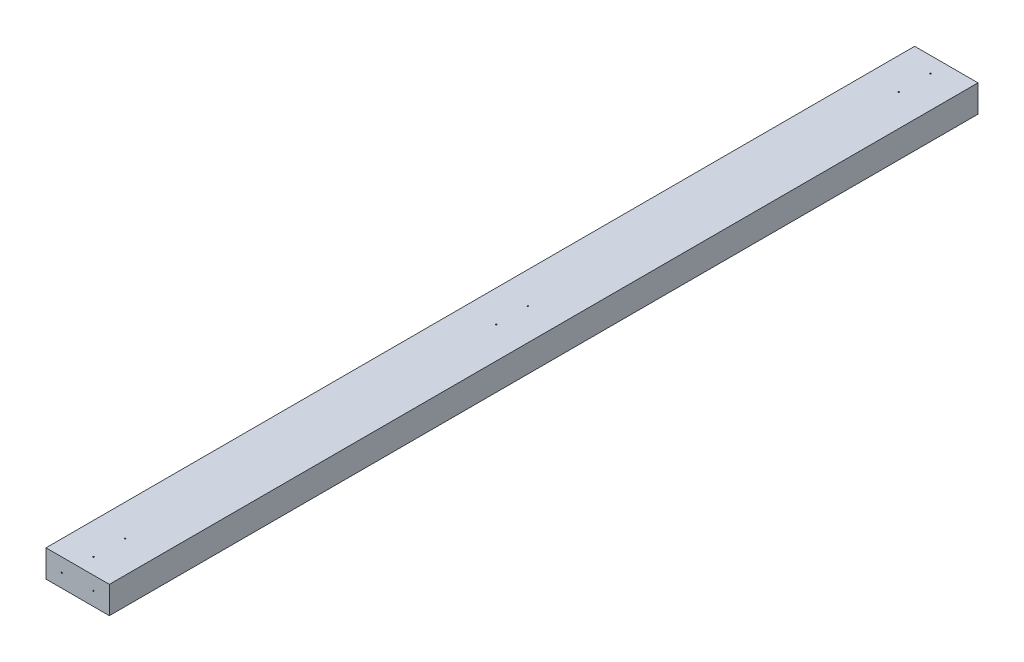
ISO-10303-21;
HEADER;
FILE_DESCRIPTION(('STEP AP214'),'2;1');
FILE_NAME('part.step','',(''),(''),'','','');
FILE_SCHEMA(('AUTOMOTIVE_DESIGN { 1 0 10303 214 1 1 1 1 }'));
ENDSEC;
DATA;
#1=APPLICATION_CONTEXT('core data for automotive mechanical design processes');
#2=APPLICATION_PROTOCOL_DEFINITION('international standard','automotive_design',2000,#1);
#3=PRODUCT_CONTEXT('',#1,'mechanical');
#4=PRODUCT('Part','Part','',(#3));
#5=PRODUCT_RELATED_PRODUCT_CATEGORY('part','',(#4));
#6=PRODUCT_DEFINITION_FORMATION('','',#4);
#7=PRODUCT_DEFINITION_CONTEXT('part definition',#1,'design');
#8=PRODUCT_DEFINITION('design','',#6,#7);
#9=PRODUCT_DEFINITION_SHAPE('','',#8);
#10=(LENGTH_UNIT() NAMED_UNIT(*) SI_UNIT(.MILLI.,.METRE.));
#11=(NAMED_UNIT(*) PLANE_ANGLE_UNIT() SI_UNIT($,.RADIAN.));
#12=(NAMED_UNIT(*) SI_UNIT($,.STERADIAN.) SOLID_ANGLE_UNIT());
#13=UNCERTAINTY_MEASURE_WITH_UNIT(LENGTH_MEASURE(1.E-05),#10,'distance_accuracy_value','');
#14=(GEOMETRIC_REPRESENTATION_CONTEXT(3) GLOBAL_UNCERTAINTY_ASSIGNED_CONTEXT((#13)) GLOBAL_UNIT_ASSIGNED_CONTEXT((#10,
#11,#12)) REPRESENTATION_CONTEXT('',''));
#15=CARTESIAN_POINT('',(0.,0.,0.));
#16=DIRECTION('',(0.,0.,1.));
#17=DIRECTION('',(1.,0.,0.));
#18=AXIS2_PLACEMENT_3D('',#15,#16,#17);
#19=CARTESIAN_POINT('',(0.,0.,1219.2));
#20=DIRECTION('',(1.,0.,0.));
#21=DIRECTION('',(0.,0.,-1.));
#22=AXIS2_PLACEMENT_3D('',#19,#20,#21);
#23=PLANE('',#22);
#24=DIRECTION('',(0.,-1.,0.));
#25=VECTOR('',#24,1.);
#26=CARTESIAN_POINT('',(0.,0.,0.));
#27=LINE('',#26,#25);
#28=CARTESIAN_POINT('',(0.,38.1,0.));
#29=VERTEX_POINT('',#28);
#30=CARTESIAN_POINT('',(0.,0.,0.));
#31=VERTEX_POINT('',#30);
#32=EDGE_CURVE('E95',#29,#31,#27,.T.);
#33=ORIENTED_EDGE('',*,*,#32,.T.);
#34=DIRECTION('',(0.,0.,-1.));
#35=VECTOR('',#34,1.);
#36=CARTESIAN_POINT('',(0.,0.,1219.2));
#37=LINE('',#36,#35);
#38=CARTESIAN_POINT('',(0.,0.,1219.2));
#39=VERTEX_POINT('',#38);
#40=EDGE_CURVE('E11',#39,#31,#37,.T.);
#41=ORIENTED_EDGE('',*,*,#40,.F.);
#42=DIRECTION('',(0.,-1.,0.));
#43=VECTOR('',#42,1.);
#44=CARTESIAN_POINT('',(0.,0.,1219.2));
#45=LINE('',#44,#43);
#46=CARTESIAN_POINT('',(0.,38.1,1219.2));
#47=VERTEX_POINT('',#46);
#48=EDGE_CURVE('E83',#47,#39,#45,.T.);
#49=ORIENTED_EDGE('',*,*,#48,.F.);
#50=DIRECTION('',(0.,0.,-1.));
#51=VECTOR('',#50,1.);
#52=CARTESIAN_POINT('',(0.,38.1,1219.2));
#53=LINE('',#52,#51);
#54=EDGE_CURVE('E91',#47,#29,#53,.T.);
#55=ORIENTED_EDGE('',*,*,#54,.T.);
#56=EDGE_LOOP('',(#33,#41,#49,#55));
#57=FACE_BOUND('',#56,.T.);
#58=ADVANCED_FACE('F32',(#57),#23,.F.);
#59=CARTESIAN_POINT('',(0.,0.,1219.2));
#60=DIRECTION('',(0.,1.,0.));
#61=DIRECTION('',(0.,0.,1.));
#62=AXIS2_PLACEMENT_3D('',#59,#60,#61);
#63=PLANE('',#62);
#64=CARTESIAN_POINT('',(44.45,0.,631.825));
#65=DIRECTION('',(0.,-1.,0.));
#66=DIRECTION('',(0.,0.,-1.));
#67=AXIS2_PLACEMENT_3D('',#64,#65,#66);
#68=CIRCLE('',#67,0.876299999999982);
#69=CARTESIAN_POINT('',(44.45,0.,630.9487));
#70=VERTEX_POINT('',#69);
#71=EDGE_CURVE('E153',#70,#70,#68,.T.);
#72=ORIENTED_EDGE('',*,*,#71,.F.);
#73=EDGE_LOOP('',(#72));
#74=FACE_BOUND('',#73,.T.);
#75=CARTESIAN_POINT('',(44.45,0.,587.375));
#76=DIRECTION('',(0.,-1.,0.));
#77=DIRECTION('',(0.,0.,-1.));
#78=AXIS2_PLACEMENT_3D('',#75,#76,#77);
#79=CIRCLE('',#78,0.876299999999989);
#80=CARTESIAN_POINT('',(44.45,0.,586.4987));
#81=VERTEX_POINT('',#80);
#82=EDGE_CURVE('E147',#81,#81,#79,.T.);
#83=ORIENTED_EDGE('',*,*,#82,.F.);
#84=EDGE_LOOP('',(#83));
#85=FACE_BOUND('',#84,.T.);
#86=CARTESIAN_POINT('',(44.45,0.,66.6750000000005));
#87=DIRECTION('',(0.,-1.,0.));
#88=DIRECTION('',(0.,0.,1.));
#89=AXIS2_PLACEMENT_3D('',#86,#87,#88);
#90=CIRCLE('',#89,0.876299999999982);
#91=CARTESIAN_POINT('',(44.45,0.,67.5513000000005));
#92=VERTEX_POINT('',#91);
#93=EDGE_CURVE('E141',#92,#92,#90,.T.);
#94=ORIENTED_EDGE('',*,*,#93,.F.);
#95=EDGE_LOOP('',(#94));
#96=FACE_BOUND('',#95,.T.);
#97=CARTESIAN_POINT('',(44.45,0.,22.2250000000004));
#98=DIRECTION('',(0.,-1.,0.));
#99=DIRECTION('',(0.,0.,1.));
#100=AXIS2_PLACEMENT_3D('',#97,#98,#99);
#101=CIRCLE('',#100,0.876299999999989);
#102=CARTESIAN_POINT('',(44.45,0.,23.1013000000004));
#103=VERTEX_POINT('',#102);
#104=EDGE_CURVE('E135',#103,#103,#101,.T.);
#105=ORIENTED_EDGE('',*,*,#104,.F.);
#106=EDGE_LOOP('',(#105));
#107=FACE_BOUND('',#106,.T.);
#108=CARTESIAN_POINT('',(44.45,0.,1152.525));
#109=DIRECTION('',(0.,-1.,0.));
#110=DIRECTION('',(0.,0.,-1.));
#111=AXIS2_PLACEMENT_3D('',#108,#109,#110);
#112=CIRCLE('',#111,0.876299999999982);
#113=CARTESIAN_POINT('',(44.45,0.,1151.6487));
#114=VERTEX_POINT('',#113);
#115=EDGE_CURVE('E129',#114,#114,#112,.T.);
#116=ORIENTED_EDGE('',*,*,#115,.F.);
#117=EDGE_LOOP('',(#116));
#118=FACE_BOUND('',#117,.T.);
#119=CARTESIAN_POINT('',(44.45,0.,1196.975));
#120=DIRECTION('',(0.,-1.,0.));
#121=DIRECTION('',(0.,0.,-1.));
#122=AXIS2_PLACEMENT_3D('',#119,#120,#121);
#123=CIRCLE('',#122,0.876299999999989);
#124=CARTESIAN_POINT('',(44.45,0.,1196.0987));
#125=VERTEX_POINT('',#124);
#126=EDGE_CURVE('E123',#125,#125,#123,.T.);
#127=ORIENTED_EDGE('',*,*,#126,.F.);
#128=EDGE_LOOP('',(#127));
#129=FACE_BOUND('',#128,.T.);
#130=DIRECTION('',(1.,0.,0.));
#131=VECTOR('',#130,1.);
#132=CARTESIAN_POINT('',(0.,0.,0.));
#133=LINE('',#132,#131);
#134=CARTESIAN_POINT('',(88.9,0.,0.));
#135=VERTEX_POINT('',#134);
#136=EDGE_CURVE('E87',#31,#135,#133,.T.);
#137=ORIENTED_EDGE('',*,*,#136,.T.);
#138=DIRECTION('',(0.,0.,-1.));
#139=VECTOR('',#138,1.);
#140=CARTESIAN_POINT('',(88.9,0.,1219.2));
#141=LINE('',#140,#139);
#142=CARTESIAN_POINT('',(88.9,0.,1219.2));
#143=VERTEX_POINT('',#142);
#144=EDGE_CURVE('E40',#143,#135,#141,.T.);
#145=ORIENTED_EDGE('',*,*,#144,.F.);
#146=DIRECTION('',(1.,0.,0.));
#147=VECTOR('',#146,1.);
#148=CARTESIAN_POINT('',(0.,0.,1219.2));
#149=LINE('',#148,#147);
#150=EDGE_CURVE('E78',#39,#143,#149,.T.);
#151=ORIENTED_EDGE('',*,*,#150,.F.);
#152=ORIENTED_EDGE('',*,*,#40,.T.);
#153=EDGE_LOOP('',(#137,#145,#151,#152));
#154=FACE_BOUND('',#153,.T.);
#155=ADVANCED_FACE('F86',(#74,#85,#96,#107,#118,#129,#154),#63,.F.);
#156=CARTESIAN_POINT('',(88.9,0.,1219.2));
#157=DIRECTION('',(-1.,0.,0.));
#158=DIRECTION('',(0.,0.,1.));
#159=AXIS2_PLACEMENT_3D('',#156,#157,#158);
#160=PLANE('',#159);
#161=DIRECTION('',(0.,1.,0.));
#162=VECTOR('',#161,1.);
#163=CARTESIAN_POINT('',(88.9,0.,0.));
#164=LINE('',#163,#162);
#165=CARTESIAN_POINT('',(88.9,38.1,0.));
#166=VERTEX_POINT('',#165);
#167=EDGE_CURVE('E65',#135,#166,#164,.T.);
#168=ORIENTED_EDGE('',*,*,#167,.T.);
#169=DIRECTION('',(0.,0.,-1.));
#170=VECTOR('',#169,1.);
#171=CARTESIAN_POINT('',(88.9,38.1,1219.2));
#172=LINE('',#171,#170);
#173=CARTESIAN_POINT('',(88.9,38.1,1219.2));
#174=VERTEX_POINT('',#173);
#175=EDGE_CURVE('E88',#174,#166,#172,.T.);
#176=ORIENTED_EDGE('',*,*,#175,.F.);
#177=DIRECTION('',(0.,1.,0.));
#178=VECTOR('',#177,1.);
#179=CARTESIAN_POINT('',(88.9,0.,1219.2));
#180=LINE('',#179,#178);
#181=EDGE_CURVE('E81',#143,#174,#180,.T.);
#182=ORIENTED_EDGE('',*,*,#181,.F.);
#183=ORIENTED_EDGE('',*,*,#144,.T.);
#184=EDGE_LOOP('',(#168,#176,#182,#183));
#185=FACE_BOUND('',#184,.T.);
#186=ADVANCED_FACE('F89',(#185),#160,.F.);
#187=CARTESIAN_POINT('',(0.,38.1,1219.2));
#188=DIRECTION('',(0.,-1.,0.));
#189=DIRECTION('',(0.,0.,-1.));
#190=AXIS2_PLACEMENT_3D('',#187,#188,#189);
#191=PLANE('',#190);
#192=CARTESIAN_POINT('',(44.45,38.1,631.825));
#193=DIRECTION('',(0.,-1.,0.));
#194=DIRECTION('',(0.,0.,-1.));
#195=AXIS2_PLACEMENT_3D('',#192,#193,#194);
#196=CIRCLE('',#195,0.876299999999982);
#197=CARTESIAN_POINT('',(44.45,38.1,630.9487));
#198=VERTEX_POINT('',#197);
#199=EDGE_CURVE('E150',#198,#198,#196,.F.);
#200=ORIENTED_EDGE('',*,*,#199,.F.);
#201=EDGE_LOOP('',(#200));
#202=FACE_BOUND('',#201,.T.);
#203=CARTESIAN_POINT('',(44.45,38.1,587.375));
#204=DIRECTION('',(0.,-1.,0.));
#205=DIRECTION('',(0.,0.,-1.));
#206=AXIS2_PLACEMENT_3D('',#203,#204,#205);
#207=CIRCLE('',#206,0.876299999999989);
#208=CARTESIAN_POINT('',(44.45,38.1,586.4987));
#209=VERTEX_POINT('',#208);
#210=EDGE_CURVE('E144',#209,#209,#207,.F.);
#211=ORIENTED_EDGE('',*,*,#210,.F.);
#212=EDGE_LOOP('',(#211));
#213=FACE_BOUND('',#212,.T.);
#214=CARTESIAN_POINT('',(44.45,38.1,66.6750000000005));
#215=DIRECTION('',(0.,-1.,0.));
#216=DIRECTION('',(0.,0.,-1.));
#217=AXIS2_PLACEMENT_3D('',#214,#215,#216);
#218=CIRCLE('',#217,0.876299999999982);
#219=CARTESIAN_POINT('',(44.45,38.1,65.7987000000005));
#220=VERTEX_POINT('',#219);
#221=EDGE_CURVE('E138',#220,#220,#218,.F.);
#222=ORIENTED_EDGE('',*,*,#221,.F.);
#223=EDGE_LOOP('',(#222));
#224=FACE_BOUND('',#223,.T.);
#225=CARTESIAN_POINT('',(44.45,38.1,22.2250000000004));
#226=DIRECTION('',(0.,-1.,0.));
#227=DIRECTION('',(0.,0.,-1.));
#228=AXIS2_PLACEMENT_3D('',#225,#226,#227);
#229=CIRCLE('',#228,0.876299999999989);
#230=CARTESIAN_POINT('',(44.45,38.1,21.3487000000004));
#231=VERTEX_POINT('',#230);
#232=EDGE_CURVE('E132',#231,#231,#229,.F.);
#233=ORIENTED_EDGE('',*,*,#232,.F.);
#234=EDGE_LOOP('',(#233));
#235=FACE_BOUND('',#234,.T.);
#236=CARTESIAN_POINT('',(44.45,38.1,1152.525));
#237=DIRECTION('',(0.,-1.,0.));
#238=DIRECTION('',(0.,0.,-1.));
#239=AXIS2_PLACEMENT_3D('',#236,#237,#238);
#240=CIRCLE('',#239,0.876299999999982);
#241=CARTESIAN_POINT('',(44.45,38.1,1151.6487));
#242=VERTEX_POINT('',#241);
#243=EDGE_CURVE('E126',#242,#242,#240,.F.);
#244=ORIENTED_EDGE('',*,*,#243,.F.);
#245=EDGE_LOOP('',(#244));
#246=FACE_BOUND('',#245,.T.);
#247=CARTESIAN_POINT('',(44.45,38.1,1196.975));
#248=DIRECTION('',(0.,-1.,0.));
#249=DIRECTION('',(0.,0.,-1.));
#250=AXIS2_PLACEMENT_3D('',#247,#248,#249);
#251=CIRCLE('',#250,0.876299999999989);
#252=CARTESIAN_POINT('',(44.45,38.1,1196.0987));
#253=VERTEX_POINT('',#252);
#254=EDGE_CURVE('E120',#253,#253,#251,.F.);
#255=ORIENTED_EDGE('',*,*,#254,.F.);
#256=EDGE_LOOP('',(#255));
#257=FACE_BOUND('',#256,.T.);
#258=DIRECTION('',(-1.,0.,0.));
#259=VECTOR('',#258,1.);
#260=CARTESIAN_POINT('',(0.,38.1,0.));
#261=LINE('',#260,#259);
#262=EDGE_CURVE('E71',#166,#29,#261,.T.);
#263=ORIENTED_EDGE('',*,*,#262,.T.);
#264=ORIENTED_EDGE('',*,*,#54,.F.);
#265=DIRECTION('',(-1.,0.,0.));
#266=VECTOR('',#265,1.);
#267=CARTESIAN_POINT('',(0.,38.1,1219.2));
#268=LINE('',#267,#266);
#269=EDGE_CURVE('E48',#174,#47,#268,.T.);
#270=ORIENTED_EDGE('',*,*,#269,.F.);
#271=ORIENTED_EDGE('',*,*,#175,.T.);
#272=EDGE_LOOP('',(#263,#264,#270,#271));
#273=FACE_BOUND('',#272,.T.);
#274=ADVANCED_FACE('F103',(#202,#213,#224,#235,#246,#257,#273),#191,.F.);
#275=CARTESIAN_POINT('',(0.,0.,1219.2));
#276=DIRECTION('',(0.,0.,-1.));
#277=DIRECTION('',(-1.,0.,0.));
#278=AXIS2_PLACEMENT_3D('',#275,#276,#277);
#279=PLANE('',#278);
#280=CARTESIAN_POINT('',(22.225,19.05,1219.2));
#281=DIRECTION('',(0.,0.,-1.));
#282=DIRECTION('',(-1.,0.,0.));
#283=AXIS2_PLACEMENT_3D('',#280,#281,#282);
#284=CIRCLE('',#283,0.876299999999999);
#285=CARTESIAN_POINT('',(21.3487,19.05,1219.2));
#286=VERTEX_POINT('',#285);
#287=EDGE_CURVE('E114',#286,#286,#284,.F.);
#288=ORIENTED_EDGE('',*,*,#287,.F.);
#289=EDGE_LOOP('',(#288));
#290=FACE_BOUND('',#289,.T.);
#291=CARTESIAN_POINT('',(66.675,19.05,1219.2));
#292=DIRECTION('',(0.,0.,-1.));
#293=DIRECTION('',(-1.,0.,0.));
#294=AXIS2_PLACEMENT_3D('',#291,#292,#293);
#295=CIRCLE('',#294,0.876300000000001);
#296=CARTESIAN_POINT('',(65.7987,19.05,1219.2));
#297=VERTEX_POINT('',#296);
#298=EDGE_CURVE('E98',#297,#297,#295,.F.);
#299=ORIENTED_EDGE('',*,*,#298,.F.);
#300=EDGE_LOOP('',(#299));
#301=FACE_BOUND('',#300,.T.);
#302=ORIENTED_EDGE('',*,*,#48,.T.);
#303=ORIENTED_EDGE('',*,*,#150,.T.);
#304=ORIENTED_EDGE('',*,*,#181,.T.);
#305=ORIENTED_EDGE('',*,*,#269,.T.);
#306=EDGE_LOOP('',(#302,#303,#304,#305));
#307=FACE_BOUND('',#306,.T.);
#308=ADVANCED_FACE('F79',(#290,#301,#307),#279,.F.);
#309=CARTESIAN_POINT('',(0.,0.,0.));
#310=DIRECTION('',(0.,0.,-1.));
#311=DIRECTION('',(-1.,0.,0.));
#312=AXIS2_PLACEMENT_3D('',#309,#310,#311);
#313=PLANE('',#312);
#314=CARTESIAN_POINT('',(22.225,19.05,0.));
#315=DIRECTION('',(0.,0.,-1.));
#316=DIRECTION('',(-1.,0.,0.));
#317=AXIS2_PLACEMENT_3D('',#314,#315,#316);
#318=CIRCLE('',#317,0.876299999999999);
#319=CARTESIAN_POINT('',(21.3487,19.05,0.));
#320=VERTEX_POINT('',#319);
#321=EDGE_CURVE('E117',#320,#320,#318,.T.);
#322=ORIENTED_EDGE('',*,*,#321,.F.);
#323=EDGE_LOOP('',(#322));
#324=FACE_BOUND('',#323,.T.);
#325=CARTESIAN_POINT('',(66.675,19.05,0.));
#326=DIRECTION('',(0.,0.,-1.));
#327=DIRECTION('',(-1.,0.,0.));
#328=AXIS2_PLACEMENT_3D('',#325,#326,#327);
#329=CIRCLE('',#328,0.876300000000001);
#330=CARTESIAN_POINT('',(65.7987,19.05,0.));
#331=VERTEX_POINT('',#330);
#332=EDGE_CURVE('E111',#331,#331,#329,.T.);
#333=ORIENTED_EDGE('',*,*,#332,.F.);
#334=EDGE_LOOP('',(#333));
#335=FACE_BOUND('',#334,.T.);
#336=ORIENTED_EDGE('',*,*,#32,.F.);
#337=ORIENTED_EDGE('',*,*,#262,.F.);
#338=ORIENTED_EDGE('',*,*,#167,.F.);
#339=ORIENTED_EDGE('',*,*,#136,.F.);
#340=EDGE_LOOP('',(#336,#337,#338,#339));
#341=FACE_BOUND('',#340,.T.);
#342=ADVANCED_FACE('F106',(#324,#335,#341),#313,.T.);
#343=CARTESIAN_POINT('',(66.675,19.05,1221.67855068942));
#344=DIRECTION('',(0.,0.,-1.));
#345=DIRECTION('',(-1.,0.,0.));
#346=AXIS2_PLACEMENT_3D('',#343,#344,#345);
#347=CYLINDRICAL_SURFACE('',#346,0.876300000000001);
#348=ORIENTED_EDGE('',*,*,#298,.T.);
#349=EDGE_LOOP('',(#348));
#350=FACE_BOUND('',#349,.T.);
#351=ORIENTED_EDGE('',*,*,#332,.T.);
#352=EDGE_LOOP('',(#351));
#353=FACE_BOUND('',#352,.T.);
#354=ADVANCED_FACE('F184',(#350,#353),#347,.F.);
#355=CARTESIAN_POINT('',(22.225,19.05,1221.67855068942));
#356=DIRECTION('',(0.,0.,-1.));
#357=DIRECTION('',(-1.,0.,0.));
#358=AXIS2_PLACEMENT_3D('',#355,#356,#357);
#359=CYLINDRICAL_SURFACE('',#358,0.876299999999999);
#360=ORIENTED_EDGE('',*,*,#287,.T.);
#361=EDGE_LOOP('',(#360));
#362=FACE_BOUND('',#361,.T.);
#363=ORIENTED_EDGE('',*,*,#321,.T.);
#364=EDGE_LOOP('',(#363));
#365=FACE_BOUND('',#364,.T.);
#366=ADVANCED_FACE('F174',(#362,#365),#359,.F.);
#367=CARTESIAN_POINT('',(44.45,40.5785506894151,1196.975));
#368=DIRECTION('',(0.,-1.,0.));
#369=DIRECTION('',(0.,0.,-1.));
#370=AXIS2_PLACEMENT_3D('',#367,#368,#369);
#371=CYLINDRICAL_SURFACE('',#370,0.876299999999989);
#372=ORIENTED_EDGE('',*,*,#254,.T.);
#373=EDGE_LOOP('',(#372));
#374=FACE_BOUND('',#373,.T.);
#375=ORIENTED_EDGE('',*,*,#126,.T.);
#376=EDGE_LOOP('',(#375));
#377=FACE_BOUND('',#376,.T.);
#378=ADVANCED_FACE('F171',(#374,#377),#371,.F.);
#379=CARTESIAN_POINT('',(44.45,40.5785506894151,1152.525));
#380=DIRECTION('',(0.,-1.,0.));
#381=DIRECTION('',(0.,0.,-1.));
#382=AXIS2_PLACEMENT_3D('',#379,#380,#381);
#383=CYLINDRICAL_SURFACE('',#382,0.876299999999982);
#384=ORIENTED_EDGE('',*,*,#243,.T.);
#385=EDGE_LOOP('',(#384));
#386=FACE_BOUND('',#385,.T.);
#387=ORIENTED_EDGE('',*,*,#115,.T.);
#388=EDGE_LOOP('',(#387));
#389=FACE_BOUND('',#388,.T.);
#390=ADVANCED_FACE('F173',(#386,#389),#383,.F.);
#391=CARTESIAN_POINT('',(44.45,40.5785506894151,22.2250000000004));
#392=DIRECTION('',(0.,-1.,0.));
#393=DIRECTION('',(0.,0.,-1.));
#394=AXIS2_PLACEMENT_3D('',#391,#392,#393);
#395=CYLINDRICAL_SURFACE('',#394,0.876299999999989);
#396=ORIENTED_EDGE('',*,*,#232,.T.);
#397=EDGE_LOOP('',(#396));
#398=FACE_BOUND('',#397,.T.);
#399=ORIENTED_EDGE('',*,*,#104,.T.);
#400=EDGE_LOOP('',(#399));
#401=FACE_BOUND('',#400,.T.);
#402=ADVANCED_FACE('F181',(#398,#401),#395,.F.);
#403=CARTESIAN_POINT('',(44.45,40.5785506894151,66.6750000000005));
#404=DIRECTION('',(0.,-1.,0.));
#405=DIRECTION('',(0.,0.,-1.));
#406=AXIS2_PLACEMENT_3D('',#403,#404,#405);
#407=CYLINDRICAL_SURFACE('',#406,0.876299999999982);
#408=ORIENTED_EDGE('',*,*,#221,.T.);
#409=EDGE_LOOP('',(#408));
#410=FACE_BOUND('',#409,.T.);
#411=ORIENTED_EDGE('',*,*,#93,.T.);
#412=EDGE_LOOP('',(#411));
#413=FACE_BOUND('',#412,.T.);
#414=ADVANCED_FACE('F257',(#410,#413),#407,.F.);
#415=CARTESIAN_POINT('',(44.45,40.5785506894151,587.375));
#416=DIRECTION('',(0.,-1.,0.));
#417=DIRECTION('',(0.,0.,-1.));
#418=AXIS2_PLACEMENT_3D('',#415,#416,#417);
#419=CYLINDRICAL_SURFACE('',#418,0.876299999999989);
#420=ORIENTED_EDGE('',*,*,#210,.T.);
#421=EDGE_LOOP('',(#420));
#422=FACE_BOUND('',#421,.T.);
#423=ORIENTED_EDGE('',*,*,#82,.T.);
#424=EDGE_LOOP('',(#423));
#425=FACE_BOUND('',#424,.T.);
#426=ADVANCED_FACE('F266',(#422,#425),#419,.F.);
#427=CARTESIAN_POINT('',(44.45,40.5785506894151,631.825));
#428=DIRECTION('',(0.,-1.,0.));
#429=DIRECTION('',(0.,0.,-1.));
#430=AXIS2_PLACEMENT_3D('',#427,#428,#429);
#431=CYLINDRICAL_SURFACE('',#430,0.876299999999982);
#432=ORIENTED_EDGE('',*,*,#199,.T.);
#433=EDGE_LOOP('',(#432));
#434=FACE_BOUND('',#433,.T.);
#435=ORIENTED_EDGE('',*,*,#71,.T.);
#436=EDGE_LOOP('',(#435));
#437=FACE_BOUND('',#436,.T.);
#438=ADVANCED_FACE('F157',(#434,#437),#431,.F.);
#439=CLOSED_SHELL('',(#58,#155,#186,#274,#308,#342,#354,#366,#378,#390,#402,#414,#426,#438));
#440=MANIFOLD_SOLID_BREP('B2',#439);
#441=ADVANCED_BREP_SHAPE_REPRESENTATION('',(#18,#440),#14);
#442=SHAPE_DEFINITION_REPRESENTATION(#9,#441);
ENDSEC;
END-ISO-10303-21;
